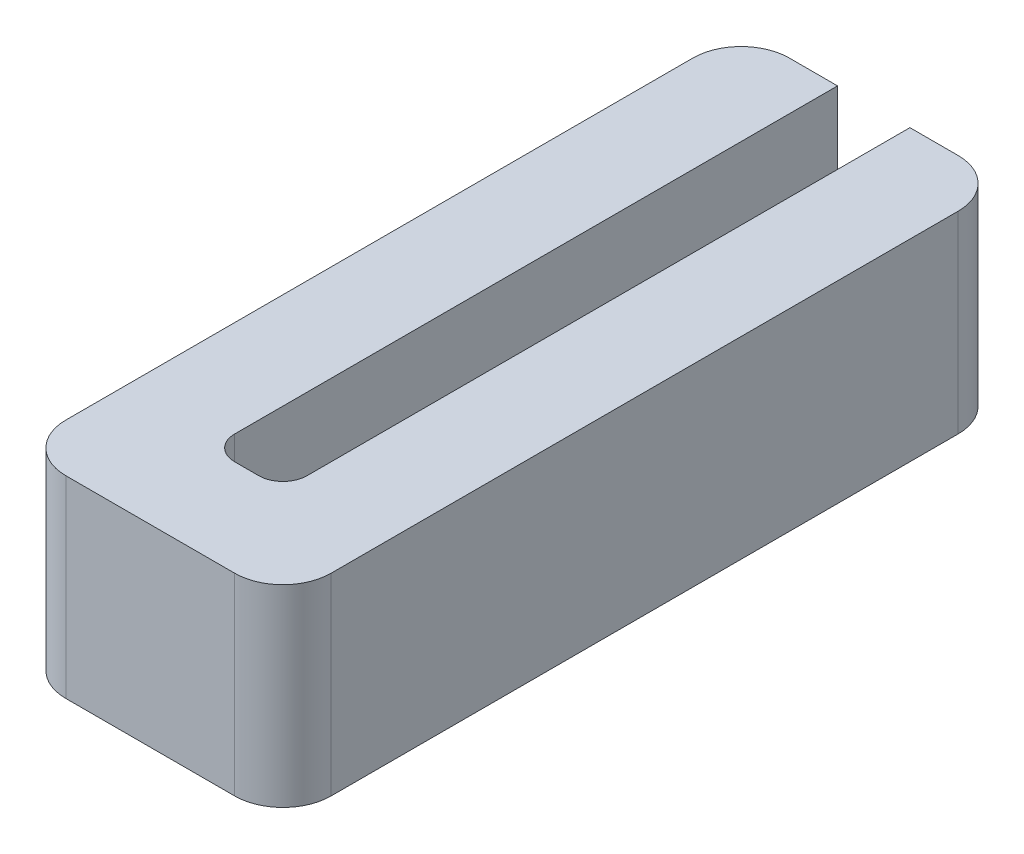
ISO-10303-21;
HEADER;
FILE_DESCRIPTION(('STEP AP214'),'2;1');
FILE_NAME('part.step','',(''),(''),'','','');
FILE_SCHEMA(('AUTOMOTIVE_DESIGN { 1 0 10303 214 1 1 1 1 }'));
ENDSEC;
DATA;
#1=APPLICATION_CONTEXT('core data for automotive mechanical design processes');
#2=APPLICATION_PROTOCOL_DEFINITION('international standard','automotive_design',2000,#1);
#3=PRODUCT_CONTEXT('',#1,'mechanical');
#4=PRODUCT('Part','Part','',(#3));
#5=PRODUCT_RELATED_PRODUCT_CATEGORY('part','',(#4));
#6=PRODUCT_DEFINITION_FORMATION('','',#4);
#7=PRODUCT_DEFINITION_CONTEXT('part definition',#1,'design');
#8=PRODUCT_DEFINITION('design','',#6,#7);
#9=PRODUCT_DEFINITION_SHAPE('','',#8);
#10=(LENGTH_UNIT() NAMED_UNIT(*) SI_UNIT(.MILLI.,.METRE.));
#11=(NAMED_UNIT(*) PLANE_ANGLE_UNIT() SI_UNIT($,.RADIAN.));
#12=(NAMED_UNIT(*) SI_UNIT($,.STERADIAN.) SOLID_ANGLE_UNIT());
#13=UNCERTAINTY_MEASURE_WITH_UNIT(LENGTH_MEASURE(1.E-05),#10,'distance_accuracy_value','');
#14=(GEOMETRIC_REPRESENTATION_CONTEXT(3) GLOBAL_UNCERTAINTY_ASSIGNED_CONTEXT((#13)) GLOBAL_UNIT_ASSIGNED_CONTEXT((#10,
#11,#12)) REPRESENTATION_CONTEXT('',''));
#15=CARTESIAN_POINT('',(0.,0.,0.));
#16=DIRECTION('',(0.,0.,1.));
#17=DIRECTION('',(1.,0.,0.));
#18=AXIS2_PLACEMENT_3D('',#15,#16,#17);
#19=CARTESIAN_POINT('',(0.,4.,0.));
#20=DIRECTION('',(1.,0.,0.));
#21=DIRECTION('',(0.,0.,-1.));
#22=AXIS2_PLACEMENT_3D('',#19,#20,#21);
#23=PLANE('',#22);
#24=DIRECTION('',(0.,0.,1.));
#25=VECTOR('',#24,1.);
#26=CARTESIAN_POINT('',(0.,4.,0.));
#27=LINE('',#26,#25);
#28=CARTESIAN_POINT('',(0.,4.,1.));
#29=VERTEX_POINT('',#28);
#30=CARTESIAN_POINT('',(0.,4.,14.));
#31=VERTEX_POINT('',#30);
#32=EDGE_CURVE('E190',#29,#31,#27,.T.);
#33=ORIENTED_EDGE('',*,*,#32,.F.);
#34=DIRECTION('',(0.,-1.,0.));
#35=VECTOR('',#34,1.);
#36=CARTESIAN_POINT('',(0.,4.,1.));
#37=LINE('',#36,#35);
#38=CARTESIAN_POINT('',(0.,0.,1.));
#39=VERTEX_POINT('',#38);
#40=EDGE_CURVE('E194',#29,#39,#37,.T.);
#41=ORIENTED_EDGE('',*,*,#40,.T.);
#42=DIRECTION('',(0.,0.,1.));
#43=VECTOR('',#42,1.);
#44=CARTESIAN_POINT('',(0.,0.,0.));
#45=LINE('',#44,#43);
#46=CARTESIAN_POINT('',(0.,0.,14.));
#47=VERTEX_POINT('',#46);
#48=EDGE_CURVE('E170',#39,#47,#45,.T.);
#49=ORIENTED_EDGE('',*,*,#48,.T.);
#50=DIRECTION('',(0.,-1.,0.));
#51=VECTOR('',#50,1.);
#52=CARTESIAN_POINT('',(0.,4.,14.));
#53=LINE('',#52,#51);
#54=EDGE_CURVE('E155',#47,#31,#53,.F.);
#55=ORIENTED_EDGE('',*,*,#54,.T.);
#56=EDGE_LOOP('',(#33,#41,#49,#55));
#57=FACE_BOUND('',#56,.T.);
#58=ADVANCED_FACE('F33',(#57),#23,.F.);
#59=CARTESIAN_POINT('',(0.,4.,15.));
#60=DIRECTION('',(0.,0.,-1.));
#61=DIRECTION('',(-1.,0.,0.));
#62=AXIS2_PLACEMENT_3D('',#59,#60,#61);
#63=PLANE('',#62);
#64=DIRECTION('',(1.,0.,0.));
#65=VECTOR('',#64,1.);
#66=CARTESIAN_POINT('',(0.,0.,15.));
#67=LINE('',#66,#65);
#68=CARTESIAN_POINT('',(1.,0.,15.));
#69=VERTEX_POINT('',#68);
#70=CARTESIAN_POINT('',(4.5,0.,15.));
#71=VERTEX_POINT('',#70);
#72=EDGE_CURVE('E173',#69,#71,#67,.T.);
#73=ORIENTED_EDGE('',*,*,#72,.T.);
#74=DIRECTION('',(0.,-1.,0.));
#75=VECTOR('',#74,1.);
#76=CARTESIAN_POINT('',(4.5,4.,15.));
#77=LINE('',#76,#75);
#78=CARTESIAN_POINT('',(4.5,4.,15.));
#79=VERTEX_POINT('',#78);
#80=EDGE_CURVE('E224',#71,#79,#77,.F.);
#81=ORIENTED_EDGE('',*,*,#80,.T.);
#82=DIRECTION('',(1.,0.,0.));
#83=VECTOR('',#82,1.);
#84=CARTESIAN_POINT('',(0.,4.,15.));
#85=LINE('',#84,#83);
#86=CARTESIAN_POINT('',(1.,4.,15.));
#87=VERTEX_POINT('',#86);
#88=EDGE_CURVE('E271',#87,#79,#85,.T.);
#89=ORIENTED_EDGE('',*,*,#88,.F.);
#90=DIRECTION('',(0.,-1.,0.));
#91=VECTOR('',#90,1.);
#92=CARTESIAN_POINT('',(1.,4.,15.));
#93=LINE('',#92,#91);
#94=EDGE_CURVE('E221',#87,#69,#93,.T.);
#95=ORIENTED_EDGE('',*,*,#94,.T.);
#96=EDGE_LOOP('',(#73,#81,#89,#95));
#97=FACE_BOUND('',#96,.T.);
#98=ADVANCED_FACE('F268',(#97),#63,.F.);
#99=CARTESIAN_POINT('',(5.5,4.,0.));
#100=DIRECTION('',(-1.,0.,0.));
#101=DIRECTION('',(0.,0.,1.));
#102=AXIS2_PLACEMENT_3D('',#99,#100,#101);
#103=PLANE('',#102);
#104=DIRECTION('',(0.,0.,-1.));
#105=VECTOR('',#104,1.);
#106=CARTESIAN_POINT('',(5.5,0.,0.));
#107=LINE('',#106,#105);
#108=CARTESIAN_POINT('',(5.5,0.,14.));
#109=VERTEX_POINT('',#108);
#110=CARTESIAN_POINT('',(5.5,0.,1.));
#111=VERTEX_POINT('',#110);
#112=EDGE_CURVE('E176',#109,#111,#107,.T.);
#113=ORIENTED_EDGE('',*,*,#112,.T.);
#114=DIRECTION('',(0.,-1.,0.));
#115=VECTOR('',#114,1.);
#116=CARTESIAN_POINT('',(5.5,4.,1.));
#117=LINE('',#116,#115);
#118=CARTESIAN_POINT('',(5.5,4.,1.));
#119=VERTEX_POINT('',#118);
#120=EDGE_CURVE('E219',#111,#119,#117,.F.);
#121=ORIENTED_EDGE('',*,*,#120,.T.);
#122=DIRECTION('',(0.,0.,-1.));
#123=VECTOR('',#122,1.);
#124=CARTESIAN_POINT('',(5.5,4.,0.));
#125=LINE('',#124,#123);
#126=CARTESIAN_POINT('',(5.5,4.,14.));
#127=VERTEX_POINT('',#126);
#128=EDGE_CURVE('E145',#127,#119,#125,.T.);
#129=ORIENTED_EDGE('',*,*,#128,.F.);
#130=DIRECTION('',(0.,-1.,0.));
#131=VECTOR('',#130,1.);
#132=CARTESIAN_POINT('',(5.5,4.,14.));
#133=LINE('',#132,#131);
#134=EDGE_CURVE('E216',#127,#109,#133,.T.);
#135=ORIENTED_EDGE('',*,*,#134,.T.);
#136=EDGE_LOOP('',(#113,#121,#129,#135));
#137=FACE_BOUND('',#136,.T.);
#138=ADVANCED_FACE('F296',(#137),#103,.F.);
#139=CARTESIAN_POINT('',(3.5,4.,0.));
#140=DIRECTION('',(0.,0.,1.));
#141=DIRECTION('',(1.,0.,0.));
#142=AXIS2_PLACEMENT_3D('',#139,#140,#141);
#143=PLANE('',#142);
#144=DIRECTION('',(-1.,0.,0.));
#145=VECTOR('',#144,1.);
#146=CARTESIAN_POINT('',(3.5,4.,0.));
#147=LINE('',#146,#145);
#148=CARTESIAN_POINT('',(4.5,4.,0.));
#149=VERTEX_POINT('',#148);
#150=CARTESIAN_POINT('',(3.5,4.,0.));
#151=VERTEX_POINT('',#150);
#152=EDGE_CURVE('E132',#149,#151,#147,.T.);
#153=ORIENTED_EDGE('',*,*,#152,.F.);
#154=DIRECTION('',(0.,-1.,0.));
#155=VECTOR('',#154,1.);
#156=CARTESIAN_POINT('',(4.5,4.,0.));
#157=LINE('',#156,#155);
#158=CARTESIAN_POINT('',(4.5,0.,0.));
#159=VERTEX_POINT('',#158);
#160=EDGE_CURVE('E214',#149,#159,#157,.T.);
#161=ORIENTED_EDGE('',*,*,#160,.T.);
#162=DIRECTION('',(-1.,0.,0.));
#163=VECTOR('',#162,1.);
#164=CARTESIAN_POINT('',(3.5,0.,0.));
#165=LINE('',#164,#163);
#166=CARTESIAN_POINT('',(3.5,0.,0.));
#167=VERTEX_POINT('',#166);
#168=EDGE_CURVE('E151',#159,#167,#165,.T.);
#169=ORIENTED_EDGE('',*,*,#168,.T.);
#170=DIRECTION('',(0.,-1.,0.));
#171=VECTOR('',#170,1.);
#172=CARTESIAN_POINT('',(3.5,4.,0.));
#173=LINE('',#172,#171);
#174=EDGE_CURVE('E148',#151,#167,#173,.T.);
#175=ORIENTED_EDGE('',*,*,#174,.F.);
#176=EDGE_LOOP('',(#153,#161,#169,#175));
#177=FACE_BOUND('',#176,.T.);
#178=ADVANCED_FACE('F149',(#177),#143,.F.);
#179=CARTESIAN_POINT('',(3.5,4.,0.));
#180=DIRECTION('',(1.,0.,0.));
#181=DIRECTION('',(0.,0.,-1.));
#182=AXIS2_PLACEMENT_3D('',#179,#180,#181);
#183=PLANE('',#182);
#184=DIRECTION('',(0.,0.,1.));
#185=VECTOR('',#184,1.);
#186=CARTESIAN_POINT('',(3.5,0.,0.));
#187=LINE('',#186,#185);
#188=CARTESIAN_POINT('',(3.5,0.,12.5));
#189=VERTEX_POINT('',#188);
#190=EDGE_CURVE('E180',#167,#189,#187,.T.);
#191=ORIENTED_EDGE('',*,*,#190,.T.);
#192=DIRECTION('',(0.,-1.,0.));
#193=VECTOR('',#192,1.);
#194=CARTESIAN_POINT('',(3.5,4.,12.5));
#195=LINE('',#194,#193);
#196=CARTESIAN_POINT('',(3.5,4.,12.5));
#197=VERTEX_POINT('',#196);
#198=EDGE_CURVE('E160',#189,#197,#195,.F.);
#199=ORIENTED_EDGE('',*,*,#198,.T.);
#200=DIRECTION('',(0.,0.,1.));
#201=VECTOR('',#200,1.);
#202=CARTESIAN_POINT('',(3.5,4.,0.));
#203=LINE('',#202,#201);
#204=EDGE_CURVE('E137',#151,#197,#203,.T.);
#205=ORIENTED_EDGE('',*,*,#204,.F.);
#206=ORIENTED_EDGE('',*,*,#174,.T.);
#207=EDGE_LOOP('',(#191,#199,#205,#206));
#208=FACE_BOUND('',#207,.T.);
#209=ADVANCED_FACE('F158',(#208),#183,.F.);
#210=CARTESIAN_POINT('',(2.,4.,13.));
#211=DIRECTION('',(0.,0.,1.));
#212=DIRECTION('',(1.,0.,0.));
#213=AXIS2_PLACEMENT_3D('',#210,#211,#212);
#214=PLANE('',#213);
#215=DIRECTION('',(-1.,0.,0.));
#216=VECTOR('',#215,1.);
#217=CARTESIAN_POINT('',(2.,4.,13.));
#218=LINE('',#217,#216);
#219=CARTESIAN_POINT('',(3.,4.,13.));
#220=VERTEX_POINT('',#219);
#221=CARTESIAN_POINT('',(2.5,4.,13.));
#222=VERTEX_POINT('',#221);
#223=EDGE_CURVE('E161',#220,#222,#218,.T.);
#224=ORIENTED_EDGE('',*,*,#223,.F.);
#225=DIRECTION('',(0.,-1.,0.));
#226=VECTOR('',#225,1.);
#227=CARTESIAN_POINT('',(3.,0.,13.));
#228=LINE('',#227,#226);
#229=CARTESIAN_POINT('',(3.,0.,13.));
#230=VERTEX_POINT('',#229);
#231=EDGE_CURVE('E228',#220,#230,#228,.T.);
#232=ORIENTED_EDGE('',*,*,#231,.T.);
#233=DIRECTION('',(-1.,0.,0.));
#234=VECTOR('',#233,1.);
#235=CARTESIAN_POINT('',(2.,0.,13.));
#236=LINE('',#235,#234);
#237=CARTESIAN_POINT('',(2.5,0.,13.));
#238=VERTEX_POINT('',#237);
#239=EDGE_CURVE('E182',#230,#238,#236,.T.);
#240=ORIENTED_EDGE('',*,*,#239,.T.);
#241=DIRECTION('',(0.,-1.,0.));
#242=VECTOR('',#241,1.);
#243=CARTESIAN_POINT('',(2.5,4.,13.));
#244=LINE('',#243,#242);
#245=EDGE_CURVE('E226',#238,#222,#244,.F.);
#246=ORIENTED_EDGE('',*,*,#245,.T.);
#247=EDGE_LOOP('',(#224,#232,#240,#246));
#248=FACE_BOUND('',#247,.T.);
#249=ADVANCED_FACE('F245',(#248),#214,.F.);
#250=CARTESIAN_POINT('',(2.,4.,0.));
#251=DIRECTION('',(-1.,0.,0.));
#252=DIRECTION('',(0.,0.,1.));
#253=AXIS2_PLACEMENT_3D('',#250,#251,#252);
#254=PLANE('',#253);
#255=DIRECTION('',(0.,0.,-1.));
#256=VECTOR('',#255,1.);
#257=CARTESIAN_POINT('',(2.,4.,0.));
#258=LINE('',#257,#256);
#259=CARTESIAN_POINT('',(2.,4.,12.5));
#260=VERTEX_POINT('',#259);
#261=CARTESIAN_POINT('',(2.,4.,0.));
#262=VERTEX_POINT('',#261);
#263=EDGE_CURVE('E163',#260,#262,#258,.T.);
#264=ORIENTED_EDGE('',*,*,#263,.F.);
#265=DIRECTION('',(0.,-1.,0.));
#266=VECTOR('',#265,1.);
#267=CARTESIAN_POINT('',(2.,0.,12.5));
#268=LINE('',#267,#266);
#269=CARTESIAN_POINT('',(2.,0.,12.5));
#270=VERTEX_POINT('',#269);
#271=EDGE_CURVE('E232',#260,#270,#268,.T.);
#272=ORIENTED_EDGE('',*,*,#271,.T.);
#273=DIRECTION('',(0.,0.,-1.));
#274=VECTOR('',#273,1.);
#275=CARTESIAN_POINT('',(2.,0.,0.));
#276=LINE('',#275,#274);
#277=CARTESIAN_POINT('',(2.,0.,0.));
#278=VERTEX_POINT('',#277);
#279=EDGE_CURVE('E185',#270,#278,#276,.T.);
#280=ORIENTED_EDGE('',*,*,#279,.T.);
#281=DIRECTION('',(0.,-1.,0.));
#282=VECTOR('',#281,1.);
#283=CARTESIAN_POINT('',(2.,4.,0.));
#284=LINE('',#283,#282);
#285=EDGE_CURVE('E156',#262,#278,#284,.T.);
#286=ORIENTED_EDGE('',*,*,#285,.F.);
#287=EDGE_LOOP('',(#264,#272,#280,#286));
#288=FACE_BOUND('',#287,.T.);
#289=ADVANCED_FACE('F248',(#288),#254,.F.);
#290=CARTESIAN_POINT('',(0.,4.,0.));
#291=DIRECTION('',(0.,0.,1.));
#292=DIRECTION('',(1.,0.,0.));
#293=AXIS2_PLACEMENT_3D('',#290,#291,#292);
#294=PLANE('',#293);
#295=DIRECTION('',(-1.,0.,0.));
#296=VECTOR('',#295,1.);
#297=CARTESIAN_POINT('',(0.,0.,0.));
#298=LINE('',#297,#296);
#299=CARTESIAN_POINT('',(1.,0.,0.));
#300=VERTEX_POINT('',#299);
#301=EDGE_CURVE('E187',#278,#300,#298,.T.);
#302=ORIENTED_EDGE('',*,*,#301,.T.);
#303=DIRECTION('',(0.,-1.,0.));
#304=VECTOR('',#303,1.);
#305=CARTESIAN_POINT('',(1.,4.,0.));
#306=LINE('',#305,#304);
#307=CARTESIAN_POINT('',(1.,4.,0.));
#308=VERTEX_POINT('',#307);
#309=EDGE_CURVE('E205',#300,#308,#306,.F.);
#310=ORIENTED_EDGE('',*,*,#309,.T.);
#311=DIRECTION('',(-1.,0.,0.));
#312=VECTOR('',#311,1.);
#313=CARTESIAN_POINT('',(0.,4.,0.));
#314=LINE('',#313,#312);
#315=EDGE_CURVE('E168',#262,#308,#314,.T.);
#316=ORIENTED_EDGE('',*,*,#315,.F.);
#317=ORIENTED_EDGE('',*,*,#285,.T.);
#318=EDGE_LOOP('',(#302,#310,#316,#317));
#319=FACE_BOUND('',#318,.T.);
#320=ADVANCED_FACE('F320',(#319),#294,.F.);
#321=CARTESIAN_POINT('',(0.,4.,0.));
#322=DIRECTION('',(0.,1.,0.));
#323=DIRECTION('',(0.,0.,1.));
#324=AXIS2_PLACEMENT_3D('',#321,#322,#323);
#325=PLANE('',#324);
#326=ORIENTED_EDGE('',*,*,#315,.T.);
#327=CARTESIAN_POINT('',(1.,4.,1.));
#328=DIRECTION('',(0.,1.,0.));
#329=DIRECTION('',(0.,0.,1.));
#330=AXIS2_PLACEMENT_3D('',#327,#328,#329);
#331=CIRCLE('',#330,1.);
#332=EDGE_CURVE('E212',#308,#29,#331,.T.);
#333=ORIENTED_EDGE('',*,*,#332,.T.);
#334=ORIENTED_EDGE('',*,*,#32,.T.);
#335=CARTESIAN_POINT('',(1.,4.,14.));
#336=DIRECTION('',(0.,1.,0.));
#337=DIRECTION('',(0.,0.,1.));
#338=AXIS2_PLACEMENT_3D('',#335,#336,#337);
#339=CIRCLE('',#338,1.);
#340=EDGE_CURVE('E207',#31,#87,#339,.T.);
#341=ORIENTED_EDGE('',*,*,#340,.T.);
#342=ORIENTED_EDGE('',*,*,#88,.T.);
#343=CARTESIAN_POINT('',(4.5,4.,14.));
#344=DIRECTION('',(0.,1.,0.));
#345=DIRECTION('',(0.,0.,1.));
#346=AXIS2_PLACEMENT_3D('',#343,#344,#345);
#347=CIRCLE('',#346,1.);
#348=EDGE_CURVE('E209',#79,#127,#347,.T.);
#349=ORIENTED_EDGE('',*,*,#348,.T.);
#350=ORIENTED_EDGE('',*,*,#128,.T.);
#351=CARTESIAN_POINT('',(4.5,4.,1.));
#352=DIRECTION('',(0.,1.,0.));
#353=DIRECTION('',(0.,0.,1.));
#354=AXIS2_PLACEMENT_3D('',#351,#352,#353);
#355=CIRCLE('',#354,1.);
#356=EDGE_CURVE('E141',#119,#149,#355,.T.);
#357=ORIENTED_EDGE('',*,*,#356,.T.);
#358=ORIENTED_EDGE('',*,*,#152,.T.);
#359=ORIENTED_EDGE('',*,*,#204,.T.);
#360=CARTESIAN_POINT('',(3.,4.,12.5));
#361=DIRECTION('',(0.,1.,0.));
#362=DIRECTION('',(0.,0.,1.));
#363=AXIS2_PLACEMENT_3D('',#360,#361,#362);
#364=CIRCLE('',#363,0.5);
#365=EDGE_CURVE('E236',#197,#220,#364,.F.);
#366=ORIENTED_EDGE('',*,*,#365,.T.);
#367=ORIENTED_EDGE('',*,*,#223,.T.);
#368=CARTESIAN_POINT('',(2.5,4.,12.5));
#369=DIRECTION('',(0.,1.,0.));
#370=DIRECTION('',(0.,0.,1.));
#371=AXIS2_PLACEMENT_3D('',#368,#369,#370);
#372=CIRCLE('',#371,0.5);
#373=EDGE_CURVE('E11',#222,#260,#372,.F.);
#374=ORIENTED_EDGE('',*,*,#373,.T.);
#375=ORIENTED_EDGE('',*,*,#263,.T.);
#376=EDGE_LOOP('',(#326,#333,#334,#341,#342,#349,#350,#357,#358,#359,#366,#367,#374,#375));
#377=FACE_BOUND('',#376,.T.);
#378=ADVANCED_FACE('F135',(#377),#325,.T.);
#379=CARTESIAN_POINT('',(0.,0.,0.));
#380=DIRECTION('',(0.,1.,0.));
#381=DIRECTION('',(0.,0.,1.));
#382=AXIS2_PLACEMENT_3D('',#379,#380,#381);
#383=PLANE('',#382);
#384=ORIENTED_EDGE('',*,*,#48,.F.);
#385=CARTESIAN_POINT('',(1.,0.,1.));
#386=DIRECTION('',(0.,1.,0.));
#387=DIRECTION('',(0.,0.,1.));
#388=AXIS2_PLACEMENT_3D('',#385,#386,#387);
#389=CIRCLE('',#388,1.);
#390=EDGE_CURVE('E203',#39,#300,#389,.F.);
#391=ORIENTED_EDGE('',*,*,#390,.T.);
#392=ORIENTED_EDGE('',*,*,#301,.F.);
#393=ORIENTED_EDGE('',*,*,#279,.F.);
#394=CARTESIAN_POINT('',(2.5,0.,12.5));
#395=DIRECTION('',(0.,1.,0.));
#396=DIRECTION('',(0.,0.,1.));
#397=AXIS2_PLACEMENT_3D('',#394,#395,#396);
#398=CIRCLE('',#397,0.5);
#399=EDGE_CURVE('E41',#270,#238,#398,.T.);
#400=ORIENTED_EDGE('',*,*,#399,.T.);
#401=ORIENTED_EDGE('',*,*,#239,.F.);
#402=CARTESIAN_POINT('',(3.,0.,12.5));
#403=DIRECTION('',(0.,1.,0.));
#404=DIRECTION('',(0.,0.,1.));
#405=AXIS2_PLACEMENT_3D('',#402,#403,#404);
#406=CIRCLE('',#405,0.5);
#407=EDGE_CURVE('E234',#230,#189,#406,.T.);
#408=ORIENTED_EDGE('',*,*,#407,.T.);
#409=ORIENTED_EDGE('',*,*,#190,.F.);
#410=ORIENTED_EDGE('',*,*,#168,.F.);
#411=CARTESIAN_POINT('',(4.5,0.,1.));
#412=DIRECTION('',(0.,1.,0.));
#413=DIRECTION('',(0.,0.,1.));
#414=AXIS2_PLACEMENT_3D('',#411,#412,#413);
#415=CIRCLE('',#414,1.);
#416=EDGE_CURVE('E201',#159,#111,#415,.F.);
#417=ORIENTED_EDGE('',*,*,#416,.T.);
#418=ORIENTED_EDGE('',*,*,#112,.F.);
#419=CARTESIAN_POINT('',(4.5,0.,14.));
#420=DIRECTION('',(0.,1.,0.));
#421=DIRECTION('',(0.,0.,1.));
#422=AXIS2_PLACEMENT_3D('',#419,#420,#421);
#423=CIRCLE('',#422,1.);
#424=EDGE_CURVE('E199',#109,#71,#423,.F.);
#425=ORIENTED_EDGE('',*,*,#424,.T.);
#426=ORIENTED_EDGE('',*,*,#72,.F.);
#427=CARTESIAN_POINT('',(1.,0.,14.));
#428=DIRECTION('',(0.,1.,0.));
#429=DIRECTION('',(0.,0.,1.));
#430=AXIS2_PLACEMENT_3D('',#427,#428,#429);
#431=CIRCLE('',#430,1.);
#432=EDGE_CURVE('E197',#69,#47,#431,.F.);
#433=ORIENTED_EDGE('',*,*,#432,.T.);
#434=EDGE_LOOP('',(#384,#391,#392,#393,#400,#401,#408,#409,#410,#417,#418,#425,#426,#433));
#435=FACE_BOUND('',#434,.T.);
#436=ADVANCED_FACE('F241',(#435),#383,.F.);
#437=CARTESIAN_POINT('',(1.,4.,1.));
#438=DIRECTION('',(0.,-1.,0.));
#439=DIRECTION('',(0.,0.,-1.));
#440=AXIS2_PLACEMENT_3D('',#437,#438,#439);
#441=CYLINDRICAL_SURFACE('',#440,1.);
#442=ORIENTED_EDGE('',*,*,#332,.F.);
#443=ORIENTED_EDGE('',*,*,#309,.F.);
#444=ORIENTED_EDGE('',*,*,#390,.F.);
#445=ORIENTED_EDGE('',*,*,#40,.F.);
#446=EDGE_LOOP('',(#442,#443,#444,#445));
#447=FACE_BOUND('',#446,.T.);
#448=ADVANCED_FACE('F258',(#447),#441,.T.);
#449=CARTESIAN_POINT('',(4.5,4.,1.));
#450=DIRECTION('',(0.,-1.,0.));
#451=DIRECTION('',(0.,0.,-1.));
#452=AXIS2_PLACEMENT_3D('',#449,#450,#451);
#453=CYLINDRICAL_SURFACE('',#452,1.);
#454=ORIENTED_EDGE('',*,*,#356,.F.);
#455=ORIENTED_EDGE('',*,*,#120,.F.);
#456=ORIENTED_EDGE('',*,*,#416,.F.);
#457=ORIENTED_EDGE('',*,*,#160,.F.);
#458=EDGE_LOOP('',(#454,#455,#456,#457));
#459=FACE_BOUND('',#458,.T.);
#460=ADVANCED_FACE('F280',(#459),#453,.T.);
#461=CARTESIAN_POINT('',(4.5,4.,14.));
#462=DIRECTION('',(0.,-1.,0.));
#463=DIRECTION('',(0.,0.,-1.));
#464=AXIS2_PLACEMENT_3D('',#461,#462,#463);
#465=CYLINDRICAL_SURFACE('',#464,1.);
#466=ORIENTED_EDGE('',*,*,#348,.F.);
#467=ORIENTED_EDGE('',*,*,#80,.F.);
#468=ORIENTED_EDGE('',*,*,#424,.F.);
#469=ORIENTED_EDGE('',*,*,#134,.F.);
#470=EDGE_LOOP('',(#466,#467,#468,#469));
#471=FACE_BOUND('',#470,.T.);
#472=ADVANCED_FACE('F289',(#471),#465,.T.);
#473=CARTESIAN_POINT('',(1.,4.,14.));
#474=DIRECTION('',(0.,-1.,0.));
#475=DIRECTION('',(0.,0.,-1.));
#476=AXIS2_PLACEMENT_3D('',#473,#474,#475);
#477=CYLINDRICAL_SURFACE('',#476,1.);
#478=ORIENTED_EDGE('',*,*,#340,.F.);
#479=ORIENTED_EDGE('',*,*,#54,.F.);
#480=ORIENTED_EDGE('',*,*,#432,.F.);
#481=ORIENTED_EDGE('',*,*,#94,.F.);
#482=EDGE_LOOP('',(#478,#479,#480,#481));
#483=FACE_BOUND('',#482,.T.);
#484=ADVANCED_FACE('F265',(#483),#477,.T.);
#485=CARTESIAN_POINT('',(3.,4.,12.5));
#486=DIRECTION('',(0.,1.,0.));
#487=DIRECTION('',(0.,0.,1.));
#488=AXIS2_PLACEMENT_3D('',#485,#486,#487);
#489=CYLINDRICAL_SURFACE('',#488,0.5);
#490=ORIENTED_EDGE('',*,*,#365,.F.);
#491=ORIENTED_EDGE('',*,*,#198,.F.);
#492=ORIENTED_EDGE('',*,*,#407,.F.);
#493=ORIENTED_EDGE('',*,*,#231,.F.);
#494=EDGE_LOOP('',(#490,#491,#492,#493));
#495=FACE_BOUND('',#494,.T.);
#496=ADVANCED_FACE('F283',(#495),#489,.F.);
#497=CARTESIAN_POINT('',(2.5,4.,12.5));
#498=DIRECTION('',(0.,1.,0.));
#499=DIRECTION('',(0.,0.,1.));
#500=AXIS2_PLACEMENT_3D('',#497,#498,#499);
#501=CYLINDRICAL_SURFACE('',#500,0.5);
#502=ORIENTED_EDGE('',*,*,#373,.F.);
#503=ORIENTED_EDGE('',*,*,#245,.F.);
#504=ORIENTED_EDGE('',*,*,#399,.F.);
#505=ORIENTED_EDGE('',*,*,#271,.F.);
#506=EDGE_LOOP('',(#502,#503,#504,#505));
#507=FACE_BOUND('',#506,.T.);
#508=ADVANCED_FACE('F35',(#507),#501,.F.);
#509=CLOSED_SHELL('',(#58,#98,#138,#178,#209,#249,#289,#320,#378,#436,#448,#460,#472,#484,#496,#508));
#510=MANIFOLD_SOLID_BREP('B2',#509);
#511=ADVANCED_BREP_SHAPE_REPRESENTATION('',(#18,#510),#14);
#512=SHAPE_DEFINITION_REPRESENTATION(#9,#511);
ENDSEC;
END-ISO-10303-21;
